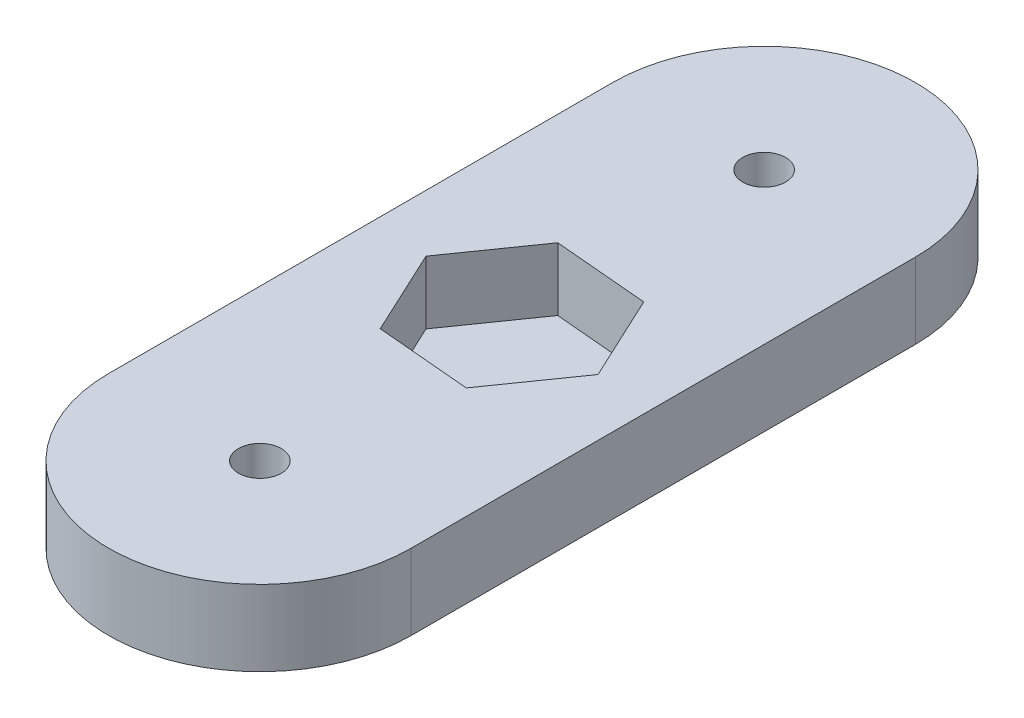
ISO-10303-21;
HEADER;
FILE_DESCRIPTION(('STEP AP214'),'2;1');
FILE_NAME('part.step','',(''),(''),'','','');
FILE_SCHEMA(('AUTOMOTIVE_DESIGN { 1 0 10303 214 1 1 1 1 }'));
ENDSEC;
DATA;
#1=APPLICATION_CONTEXT('core data for automotive mechanical design processes');
#2=APPLICATION_PROTOCOL_DEFINITION('international standard','automotive_design',2000,#1);
#3=PRODUCT_CONTEXT('',#1,'mechanical');
#4=PRODUCT('Part','Part','',(#3));
#5=PRODUCT_RELATED_PRODUCT_CATEGORY('part','',(#4));
#6=PRODUCT_DEFINITION_FORMATION('','',#4);
#7=PRODUCT_DEFINITION_CONTEXT('part definition',#1,'design');
#8=PRODUCT_DEFINITION('design','',#6,#7);
#9=PRODUCT_DEFINITION_SHAPE('','',#8);
#10=(LENGTH_UNIT() NAMED_UNIT(*) SI_UNIT(.MILLI.,.METRE.));
#11=(NAMED_UNIT(*) PLANE_ANGLE_UNIT() SI_UNIT($,.RADIAN.));
#12=(NAMED_UNIT(*) SI_UNIT($,.STERADIAN.) SOLID_ANGLE_UNIT());
#13=UNCERTAINTY_MEASURE_WITH_UNIT(LENGTH_MEASURE(1.E-05),#10,'distance_accuracy_value','');
#14=(GEOMETRIC_REPRESENTATION_CONTEXT(3) GLOBAL_UNCERTAINTY_ASSIGNED_CONTEXT((#13)) GLOBAL_UNIT_ASSIGNED_CONTEXT((#10,
#11,#12)) REPRESENTATION_CONTEXT('',''));
#15=CARTESIAN_POINT('',(0.,0.,0.));
#16=DIRECTION('',(0.,0.,1.));
#17=DIRECTION('',(1.,0.,0.));
#18=AXIS2_PLACEMENT_3D('',#15,#16,#17);
#19=CARTESIAN_POINT('',(0.,6.,0.));
#20=DIRECTION('',(0.,1.,0.));
#21=DIRECTION('',(0.,0.,1.));
#22=AXIS2_PLACEMENT_3D('',#19,#20,#21);
#23=PLANE('',#22);
#24=DIRECTION('',(0.996194698091746,0.,0.0871557427476549));
#25=VECTOR('',#24,1.);
#26=CARTESIAN_POINT('',(-4.30500862906531,6.,-13.8518105073927));
#27=LINE('',#26,#25);
#28=CARTESIAN_POINT('',(-4.30500862906531,6.,-13.8518105073927));
#29=VERTEX_POINT('',#28);
#30=CARTESIAN_POINT('',(3.1719839733458,6.,-13.1976584174146));
#31=VERTEX_POINT('',#30);
#32=EDGE_CURVE('E48',#29,#31,#27,.T.);
#33=ORIENTED_EDGE('',*,*,#32,.F.);
#34=DIRECTION('',(0.422618261740702,0.,0.906307787036649));
#35=VECTOR('',#34,1.);
#36=CARTESIAN_POINT('',(-7.47699260241112,6.,-20.6541520899781));
#37=LINE('',#36,#35);
#38=CARTESIAN_POINT('',(-7.47699260241112,6.,-20.6541520899781));
#39=VERTEX_POINT('',#38);
#40=EDGE_CURVE('E140',#39,#29,#37,.T.);
#41=ORIENTED_EDGE('',*,*,#40,.F.);
#42=DIRECTION('',(-0.573576436351043,0.,0.819152044288994));
#43=VECTOR('',#42,1.);
#44=CARTESIAN_POINT('',(-3.1719839733458,6.,-26.8023415825854));
#45=LINE('',#44,#43);
#46=CARTESIAN_POINT('',(-3.1719839733458,6.,-26.8023415825854));
#47=VERTEX_POINT('',#46);
#48=EDGE_CURVE('E143',#47,#39,#45,.T.);
#49=ORIENTED_EDGE('',*,*,#48,.F.);
#50=DIRECTION('',(-0.996194698091746,0.,-0.0871557427476554));
#51=VECTOR('',#50,1.);
#52=CARTESIAN_POINT('',(4.30500862906531,6.,-26.1481894926073));
#53=LINE('',#52,#51);
#54=CARTESIAN_POINT('',(4.30500862906531,6.,-26.1481894926073));
#55=VERTEX_POINT('',#54);
#56=EDGE_CURVE('E159',#55,#47,#53,.T.);
#57=ORIENTED_EDGE('',*,*,#56,.F.);
#58=DIRECTION('',(-0.422618261740703,0.,-0.906307787036648));
#59=VECTOR('',#58,1.);
#60=CARTESIAN_POINT('',(7.47699260241112,6.,-19.3458479100219));
#61=LINE('',#60,#59);
#62=CARTESIAN_POINT('',(7.47699260241112,6.,-19.3458479100219));
#63=VERTEX_POINT('',#62);
#64=EDGE_CURVE('E156',#63,#55,#61,.T.);
#65=ORIENTED_EDGE('',*,*,#64,.F.);
#66=DIRECTION('',(0.573576436351044,0.,-0.819152044288994));
#67=VECTOR('',#66,1.);
#68=CARTESIAN_POINT('',(3.1719839733458,6.,-13.1976584174146));
#69=LINE('',#68,#67);
#70=EDGE_CURVE('E154',#31,#63,#69,.T.);
#71=ORIENTED_EDGE('',*,*,#70,.F.);
#72=EDGE_LOOP('',(#33,#41,#49,#57,#65,#71));
#73=FACE_BOUND('',#72,.T.);
#74=CARTESIAN_POINT('',(0.,6.,-40.));
#75=DIRECTION('',(0.,1.,0.));
#76=DIRECTION('',(0.,0.,1.));
#77=AXIS2_PLACEMENT_3D('',#74,#75,#76);
#78=CIRCLE('',#77,1.7);
#79=CARTESIAN_POINT('',(0.,6.,-38.3));
#80=VERTEX_POINT('',#79);
#81=EDGE_CURVE('E180',#80,#80,#78,.T.);
#82=ORIENTED_EDGE('',*,*,#81,.F.);
#83=EDGE_LOOP('',(#82));
#84=FACE_BOUND('',#83,.T.);
#85=CARTESIAN_POINT('',(0.,6.,0.));
#86=DIRECTION('',(0.,1.,0.));
#87=DIRECTION('',(0.,0.,1.));
#88=AXIS2_PLACEMENT_3D('',#85,#86,#87);
#89=CIRCLE('',#88,12.);
#90=CARTESIAN_POINT('',(-12.,6.,0.));
#91=VERTEX_POINT('',#90);
#92=CARTESIAN_POINT('',(12.,6.,0.));
#93=VERTEX_POINT('',#92);
#94=EDGE_CURVE('E186',#91,#93,#89,.T.);
#95=ORIENTED_EDGE('',*,*,#94,.T.);
#96=DIRECTION('',(0.,0.,-1.));
#97=VECTOR('',#96,1.);
#98=CARTESIAN_POINT('',(12.,6.,0.));
#99=LINE('',#98,#97);
#100=CARTESIAN_POINT('',(12.,6.,-40.));
#101=VERTEX_POINT('',#100);
#102=EDGE_CURVE('E85',#93,#101,#99,.T.);
#103=ORIENTED_EDGE('',*,*,#102,.T.);
#104=CARTESIAN_POINT('',(0.,6.,-40.));
#105=DIRECTION('',(0.,1.,0.));
#106=DIRECTION('',(0.,0.,1.));
#107=AXIS2_PLACEMENT_3D('',#104,#105,#106);
#108=CIRCLE('',#107,12.);
#109=CARTESIAN_POINT('',(-12.,6.,-40.));
#110=VERTEX_POINT('',#109);
#111=EDGE_CURVE('E189',#101,#110,#108,.T.);
#112=ORIENTED_EDGE('',*,*,#111,.T.);
#113=DIRECTION('',(0.,0.,1.));
#114=VECTOR('',#113,1.);
#115=CARTESIAN_POINT('',(-12.,6.,0.));
#116=LINE('',#115,#114);
#117=EDGE_CURVE('E57',#110,#91,#116,.T.);
#118=ORIENTED_EDGE('',*,*,#117,.T.);
#119=EDGE_LOOP('',(#95,#103,#112,#118));
#120=FACE_BOUND('',#119,.T.);
#121=CARTESIAN_POINT('',(0.,6.,0.));
#122=DIRECTION('',(0.,1.,0.));
#123=DIRECTION('',(0.,0.,1.));
#124=AXIS2_PLACEMENT_3D('',#121,#122,#123);
#125=CIRCLE('',#124,1.7);
#126=CARTESIAN_POINT('',(0.,6.,1.7));
#127=VERTEX_POINT('',#126);
#128=EDGE_CURVE('E174',#127,#127,#125,.T.);
#129=ORIENTED_EDGE('',*,*,#128,.F.);
#130=EDGE_LOOP('',(#129));
#131=FACE_BOUND('',#130,.T.);
#132=ADVANCED_FACE('F33',(#73,#84,#120,#131),#23,.T.);
#133=CARTESIAN_POINT('',(0.,0.,0.));
#134=DIRECTION('',(0.,1.,0.));
#135=DIRECTION('',(0.,0.,1.));
#136=AXIS2_PLACEMENT_3D('',#133,#134,#135);
#137=PLANE('',#136);
#138=CARTESIAN_POINT('',(0.,0.,-40.));
#139=DIRECTION('',(0.,1.,0.));
#140=DIRECTION('',(0.,0.,1.));
#141=AXIS2_PLACEMENT_3D('',#138,#139,#140);
#142=CIRCLE('',#141,1.7);
#143=CARTESIAN_POINT('',(0.,0.,-38.3));
#144=VERTEX_POINT('',#143);
#145=EDGE_CURVE('E177',#144,#144,#142,.T.);
#146=ORIENTED_EDGE('',*,*,#145,.T.);
#147=EDGE_LOOP('',(#146));
#148=FACE_BOUND('',#147,.T.);
#149=CARTESIAN_POINT('',(0.,0.,0.));
#150=DIRECTION('',(0.,1.,0.));
#151=DIRECTION('',(0.,0.,1.));
#152=AXIS2_PLACEMENT_3D('',#149,#150,#151);
#153=CIRCLE('',#152,12.);
#154=CARTESIAN_POINT('',(-12.,0.,0.));
#155=VERTEX_POINT('',#154);
#156=CARTESIAN_POINT('',(12.,0.,0.));
#157=VERTEX_POINT('',#156);
#158=EDGE_CURVE('E183',#155,#157,#153,.T.);
#159=ORIENTED_EDGE('',*,*,#158,.F.);
#160=DIRECTION('',(0.,0.,1.));
#161=VECTOR('',#160,1.);
#162=CARTESIAN_POINT('',(-12.,0.,0.));
#163=LINE('',#162,#161);
#164=CARTESIAN_POINT('',(-12.,0.,-40.));
#165=VERTEX_POINT('',#164);
#166=EDGE_CURVE('E78',#165,#155,#163,.T.);
#167=ORIENTED_EDGE('',*,*,#166,.F.);
#168=CARTESIAN_POINT('',(0.,0.,-40.));
#169=DIRECTION('',(0.,1.,0.));
#170=DIRECTION('',(0.,0.,1.));
#171=AXIS2_PLACEMENT_3D('',#168,#169,#170);
#172=CIRCLE('',#171,12.);
#173=CARTESIAN_POINT('',(12.,0.,-40.));
#174=VERTEX_POINT('',#173);
#175=EDGE_CURVE('E197',#174,#165,#172,.T.);
#176=ORIENTED_EDGE('',*,*,#175,.F.);
#177=DIRECTION('',(0.,0.,-1.));
#178=VECTOR('',#177,1.);
#179=CARTESIAN_POINT('',(12.,0.,0.));
#180=LINE('',#179,#178);
#181=EDGE_CURVE('E195',#157,#174,#180,.T.);
#182=ORIENTED_EDGE('',*,*,#181,.F.);
#183=EDGE_LOOP('',(#159,#167,#176,#182));
#184=FACE_BOUND('',#183,.T.);
#185=CARTESIAN_POINT('',(0.,0.,0.));
#186=DIRECTION('',(0.,1.,0.));
#187=DIRECTION('',(0.,0.,1.));
#188=AXIS2_PLACEMENT_3D('',#185,#186,#187);
#189=CIRCLE('',#188,1.7);
#190=CARTESIAN_POINT('',(0.,0.,1.7));
#191=VERTEX_POINT('',#190);
#192=EDGE_CURVE('E166',#191,#191,#189,.T.);
#193=ORIENTED_EDGE('',*,*,#192,.T.);
#194=EDGE_LOOP('',(#193));
#195=FACE_BOUND('',#194,.T.);
#196=ADVANCED_FACE('F210',(#148,#184,#195),#137,.F.);
#197=CARTESIAN_POINT('',(0.,6.,0.));
#198=DIRECTION('',(0.,-1.,0.));
#199=DIRECTION('',(0.,0.,-1.));
#200=AXIS2_PLACEMENT_3D('',#197,#198,#199);
#201=CYLINDRICAL_SURFACE('',#200,12.);
#202=ORIENTED_EDGE('',*,*,#158,.T.);
#203=DIRECTION('',(0.,-1.,0.));
#204=VECTOR('',#203,1.);
#205=CARTESIAN_POINT('',(12.,6.,0.));
#206=LINE('',#205,#204);
#207=EDGE_CURVE('E11',#93,#157,#206,.T.);
#208=ORIENTED_EDGE('',*,*,#207,.F.);
#209=ORIENTED_EDGE('',*,*,#94,.F.);
#210=DIRECTION('',(0.,-1.,0.));
#211=VECTOR('',#210,1.);
#212=CARTESIAN_POINT('',(-12.,6.,0.));
#213=LINE('',#212,#211);
#214=EDGE_CURVE('E192',#91,#155,#213,.T.);
#215=ORIENTED_EDGE('',*,*,#214,.T.);
#216=EDGE_LOOP('',(#202,#208,#209,#215));
#217=FACE_BOUND('',#216,.T.);
#218=ADVANCED_FACE('F35',(#217),#201,.T.);
#219=CARTESIAN_POINT('',(12.,6.,0.));
#220=DIRECTION('',(-1.,0.,0.));
#221=DIRECTION('',(0.,0.,1.));
#222=AXIS2_PLACEMENT_3D('',#219,#220,#221);
#223=PLANE('',#222);
#224=ORIENTED_EDGE('',*,*,#181,.T.);
#225=DIRECTION('',(0.,-1.,0.));
#226=VECTOR('',#225,1.);
#227=CARTESIAN_POINT('',(12.,6.,-40.));
#228=LINE('',#227,#226);
#229=EDGE_CURVE('E41',#101,#174,#228,.T.);
#230=ORIENTED_EDGE('',*,*,#229,.F.);
#231=ORIENTED_EDGE('',*,*,#102,.F.);
#232=ORIENTED_EDGE('',*,*,#207,.T.);
#233=EDGE_LOOP('',(#224,#230,#231,#232));
#234=FACE_BOUND('',#233,.T.);
#235=ADVANCED_FACE('F226',(#234),#223,.F.);
#236=CARTESIAN_POINT('',(0.,6.,-40.));
#237=DIRECTION('',(0.,-1.,0.));
#238=DIRECTION('',(0.,0.,-1.));
#239=AXIS2_PLACEMENT_3D('',#236,#237,#238);
#240=CYLINDRICAL_SURFACE('',#239,12.);
#241=ORIENTED_EDGE('',*,*,#175,.T.);
#242=DIRECTION('',(0.,-1.,0.));
#243=VECTOR('',#242,1.);
#244=CARTESIAN_POINT('',(-12.,6.,-40.));
#245=LINE('',#244,#243);
#246=EDGE_CURVE('E201',#110,#165,#245,.T.);
#247=ORIENTED_EDGE('',*,*,#246,.F.);
#248=ORIENTED_EDGE('',*,*,#111,.F.);
#249=ORIENTED_EDGE('',*,*,#229,.T.);
#250=EDGE_LOOP('',(#241,#247,#248,#249));
#251=FACE_BOUND('',#250,.T.);
#252=ADVANCED_FACE('F206',(#251),#240,.T.);
#253=CARTESIAN_POINT('',(-12.,6.,0.));
#254=DIRECTION('',(1.,0.,0.));
#255=DIRECTION('',(0.,0.,-1.));
#256=AXIS2_PLACEMENT_3D('',#253,#254,#255);
#257=PLANE('',#256);
#258=ORIENTED_EDGE('',*,*,#166,.T.);
#259=ORIENTED_EDGE('',*,*,#214,.F.);
#260=ORIENTED_EDGE('',*,*,#117,.F.);
#261=ORIENTED_EDGE('',*,*,#246,.T.);
#262=EDGE_LOOP('',(#258,#259,#260,#261));
#263=FACE_BOUND('',#262,.T.);
#264=ADVANCED_FACE('F215',(#263),#257,.F.);
#265=CARTESIAN_POINT('',(0.,6.,-40.));
#266=DIRECTION('',(0.,-1.,0.));
#267=DIRECTION('',(0.,0.,-1.));
#268=AXIS2_PLACEMENT_3D('',#265,#266,#267);
#269=CYLINDRICAL_SURFACE('',#268,1.7);
#270=ORIENTED_EDGE('',*,*,#81,.T.);
#271=EDGE_LOOP('',(#270));
#272=FACE_BOUND('',#271,.T.);
#273=ORIENTED_EDGE('',*,*,#145,.F.);
#274=EDGE_LOOP('',(#273));
#275=FACE_BOUND('',#274,.T.);
#276=ADVANCED_FACE('F217',(#272,#275),#269,.F.);
#277=CARTESIAN_POINT('',(0.,6.,0.));
#278=DIRECTION('',(0.,-1.,0.));
#279=DIRECTION('',(0.,0.,-1.));
#280=AXIS2_PLACEMENT_3D('',#277,#278,#279);
#281=CYLINDRICAL_SURFACE('',#280,1.7);
#282=ORIENTED_EDGE('',*,*,#128,.T.);
#283=EDGE_LOOP('',(#282));
#284=FACE_BOUND('',#283,.T.);
#285=ORIENTED_EDGE('',*,*,#192,.F.);
#286=EDGE_LOOP('',(#285));
#287=FACE_BOUND('',#286,.T.);
#288=ADVANCED_FACE('F223',(#284,#287),#281,.F.);
#289=CARTESIAN_POINT('',(-4.30500862906531,1.,-13.8518105073927));
#290=DIRECTION('',(-0.0871557427476549,0.,0.996194698091746));
#291=DIRECTION('',(0.996194698091746,0.,0.0871557427476549));
#292=AXIS2_PLACEMENT_3D('',#289,#290,#291);
#293=PLANE('',#292);
#294=ORIENTED_EDGE('',*,*,#32,.T.);
#295=DIRECTION('',(0.,1.,0.));
#296=VECTOR('',#295,1.);
#297=CARTESIAN_POINT('',(3.1719839733458,1.,-13.1976584174146));
#298=LINE('',#297,#296);
#299=CARTESIAN_POINT('',(3.1719839733458,1.,-13.1976584174146));
#300=VERTEX_POINT('',#299);
#301=EDGE_CURVE('E117',#300,#31,#298,.T.);
#302=ORIENTED_EDGE('',*,*,#301,.F.);
#303=DIRECTION('',(0.996194698091746,0.,0.0871557427476549));
#304=VECTOR('',#303,1.);
#305=CARTESIAN_POINT('',(-4.30500862906531,1.,-13.8518105073927));
#306=LINE('',#305,#304);
#307=CARTESIAN_POINT('',(-4.30500862906531,1.,-13.8518105073927));
#308=VERTEX_POINT('',#307);
#309=EDGE_CURVE('E121',#308,#300,#306,.T.);
#310=ORIENTED_EDGE('',*,*,#309,.F.);
#311=DIRECTION('',(0.,1.,0.));
#312=VECTOR('',#311,1.);
#313=CARTESIAN_POINT('',(-4.30500862906531,1.,-13.8518105073927));
#314=LINE('',#313,#312);
#315=EDGE_CURVE('E164',#308,#29,#314,.T.);
#316=ORIENTED_EDGE('',*,*,#315,.T.);
#317=EDGE_LOOP('',(#294,#302,#310,#316));
#318=FACE_BOUND('',#317,.T.);
#319=ADVANCED_FACE('F119',(#318),#293,.F.);
#320=CARTESIAN_POINT('',(-7.47699260241112,1.,-20.6541520899781));
#321=DIRECTION('',(-0.906307787036649,0.,0.422618261740702));
#322=DIRECTION('',(0.422618261740702,0.,0.906307787036649));
#323=AXIS2_PLACEMENT_3D('',#320,#321,#322);
#324=PLANE('',#323);
#325=ORIENTED_EDGE('',*,*,#40,.T.);
#326=ORIENTED_EDGE('',*,*,#315,.F.);
#327=DIRECTION('',(0.422618261740702,0.,0.906307787036649));
#328=VECTOR('',#327,1.);
#329=CARTESIAN_POINT('',(-7.47699260241112,1.,-20.6541520899781));
#330=LINE('',#329,#328);
#331=CARTESIAN_POINT('',(-7.47699260241112,1.,-20.6541520899781));
#332=VERTEX_POINT('',#331);
#333=EDGE_CURVE('E127',#332,#308,#330,.T.);
#334=ORIENTED_EDGE('',*,*,#333,.F.);
#335=DIRECTION('',(0.,1.,0.));
#336=VECTOR('',#335,1.);
#337=CARTESIAN_POINT('',(-7.47699260241112,1.,-20.6541520899781));
#338=LINE('',#337,#336);
#339=EDGE_CURVE('E167',#332,#39,#338,.T.);
#340=ORIENTED_EDGE('',*,*,#339,.T.);
#341=EDGE_LOOP('',(#325,#326,#334,#340));
#342=FACE_BOUND('',#341,.T.);
#343=ADVANCED_FACE('F243',(#342),#324,.F.);
#344=CARTESIAN_POINT('',(-3.1719839733458,1.,-26.8023415825854));
#345=DIRECTION('',(-0.819152044288994,0.,-0.573576436351043));
#346=DIRECTION('',(-0.573576436351043,0.,0.819152044288994));
#347=AXIS2_PLACEMENT_3D('',#344,#345,#346);
#348=PLANE('',#347);
#349=ORIENTED_EDGE('',*,*,#48,.T.);
#350=ORIENTED_EDGE('',*,*,#339,.F.);
#351=DIRECTION('',(-0.573576436351043,0.,0.819152044288994));
#352=VECTOR('',#351,1.);
#353=CARTESIAN_POINT('',(-3.1719839733458,1.,-26.8023415825854));
#354=LINE('',#353,#352);
#355=CARTESIAN_POINT('',(-3.1719839733458,1.,-26.8023415825854));
#356=VERTEX_POINT('',#355);
#357=EDGE_CURVE('E150',#356,#332,#354,.T.);
#358=ORIENTED_EDGE('',*,*,#357,.F.);
#359=DIRECTION('',(0.,1.,0.));
#360=VECTOR('',#359,1.);
#361=CARTESIAN_POINT('',(-3.1719839733458,1.,-26.8023415825854));
#362=LINE('',#361,#360);
#363=EDGE_CURVE('E169',#356,#47,#362,.T.);
#364=ORIENTED_EDGE('',*,*,#363,.T.);
#365=EDGE_LOOP('',(#349,#350,#358,#364));
#366=FACE_BOUND('',#365,.T.);
#367=ADVANCED_FACE('F253',(#366),#348,.F.);
#368=CARTESIAN_POINT('',(4.30500862906531,1.,-26.1481894926073));
#369=DIRECTION('',(0.0871557427476554,0.,-0.996194698091746));
#370=DIRECTION('',(-0.996194698091746,0.,-0.0871557427476554));
#371=AXIS2_PLACEMENT_3D('',#368,#369,#370);
#372=PLANE('',#371);
#373=ORIENTED_EDGE('',*,*,#56,.T.);
#374=ORIENTED_EDGE('',*,*,#363,.F.);
#375=DIRECTION('',(-0.996194698091746,0.,-0.0871557427476554));
#376=VECTOR('',#375,1.);
#377=CARTESIAN_POINT('',(4.30500862906531,1.,-26.1481894926073));
#378=LINE('',#377,#376);
#379=CARTESIAN_POINT('',(4.30500862906531,1.,-26.1481894926073));
#380=VERTEX_POINT('',#379);
#381=EDGE_CURVE('E147',#380,#356,#378,.T.);
#382=ORIENTED_EDGE('',*,*,#381,.F.);
#383=DIRECTION('',(0.,1.,0.));
#384=VECTOR('',#383,1.);
#385=CARTESIAN_POINT('',(4.30500862906531,1.,-26.1481894926073));
#386=LINE('',#385,#384);
#387=EDGE_CURVE('E171',#380,#55,#386,.T.);
#388=ORIENTED_EDGE('',*,*,#387,.T.);
#389=EDGE_LOOP('',(#373,#374,#382,#388));
#390=FACE_BOUND('',#389,.T.);
#391=ADVANCED_FACE('F249',(#390),#372,.F.);
#392=CARTESIAN_POINT('',(7.47699260241112,1.,-19.3458479100219));
#393=DIRECTION('',(0.906307787036648,0.,-0.422618261740703));
#394=DIRECTION('',(-0.422618261740703,0.,-0.906307787036648));
#395=AXIS2_PLACEMENT_3D('',#392,#393,#394);
#396=PLANE('',#395);
#397=ORIENTED_EDGE('',*,*,#64,.T.);
#398=ORIENTED_EDGE('',*,*,#387,.F.);
#399=DIRECTION('',(-0.422618261740703,0.,-0.906307787036648));
#400=VECTOR('',#399,1.);
#401=CARTESIAN_POINT('',(7.47699260241112,1.,-19.3458479100219));
#402=LINE('',#401,#400);
#403=CARTESIAN_POINT('',(7.47699260241112,1.,-19.3458479100219));
#404=VERTEX_POINT('',#403);
#405=EDGE_CURVE('E135',#404,#380,#402,.T.);
#406=ORIENTED_EDGE('',*,*,#405,.F.);
#407=DIRECTION('',(0.,1.,0.));
#408=VECTOR('',#407,1.);
#409=CARTESIAN_POINT('',(7.47699260241112,1.,-19.3458479100219));
#410=LINE('',#409,#408);
#411=EDGE_CURVE('E126',#404,#63,#410,.T.);
#412=ORIENTED_EDGE('',*,*,#411,.T.);
#413=EDGE_LOOP('',(#397,#398,#406,#412));
#414=FACE_BOUND('',#413,.T.);
#415=ADVANCED_FACE('F246',(#414),#396,.F.);
#416=CARTESIAN_POINT('',(3.1719839733458,1.,-13.1976584174146));
#417=DIRECTION('',(0.819152044288994,0.,0.573576436351044));
#418=DIRECTION('',(0.573576436351044,0.,-0.819152044288994));
#419=AXIS2_PLACEMENT_3D('',#416,#417,#418);
#420=PLANE('',#419);
#421=ORIENTED_EDGE('',*,*,#70,.T.);
#422=ORIENTED_EDGE('',*,*,#411,.F.);
#423=DIRECTION('',(0.573576436351044,0.,-0.819152044288994));
#424=VECTOR('',#423,1.);
#425=CARTESIAN_POINT('',(3.1719839733458,1.,-13.1976584174146));
#426=LINE('',#425,#424);
#427=EDGE_CURVE('E130',#300,#404,#426,.T.);
#428=ORIENTED_EDGE('',*,*,#427,.F.);
#429=ORIENTED_EDGE('',*,*,#301,.T.);
#430=EDGE_LOOP('',(#421,#422,#428,#429));
#431=FACE_BOUND('',#430,.T.);
#432=ADVANCED_FACE('F131',(#431),#420,.F.);
#433=CARTESIAN_POINT('',(0.,1.,0.));
#434=DIRECTION('',(0.,1.,0.));
#435=DIRECTION('',(0.,0.,1.));
#436=AXIS2_PLACEMENT_3D('',#433,#434,#435);
#437=PLANE('',#436);
#438=ORIENTED_EDGE('',*,*,#309,.T.);
#439=ORIENTED_EDGE('',*,*,#427,.T.);
#440=ORIENTED_EDGE('',*,*,#405,.T.);
#441=ORIENTED_EDGE('',*,*,#381,.T.);
#442=ORIENTED_EDGE('',*,*,#357,.T.);
#443=ORIENTED_EDGE('',*,*,#333,.T.);
#444=EDGE_LOOP('',(#438,#439,#440,#441,#442,#443));
#445=FACE_BOUND('',#444,.T.);
#446=ADVANCED_FACE('F137',(#445),#437,.T.);
#447=CLOSED_SHELL('',(#132,#196,#218,#235,#252,#264,#276,#288,#319,#343,#367,#391,#415,#432,#446));
#448=MANIFOLD_SOLID_BREP('B2',#447);
#449=ADVANCED_BREP_SHAPE_REPRESENTATION('',(#18,#448),#14);
#450=SHAPE_DEFINITION_REPRESENTATION(#9,#449);
ENDSEC;
END-ISO-10303-21;
